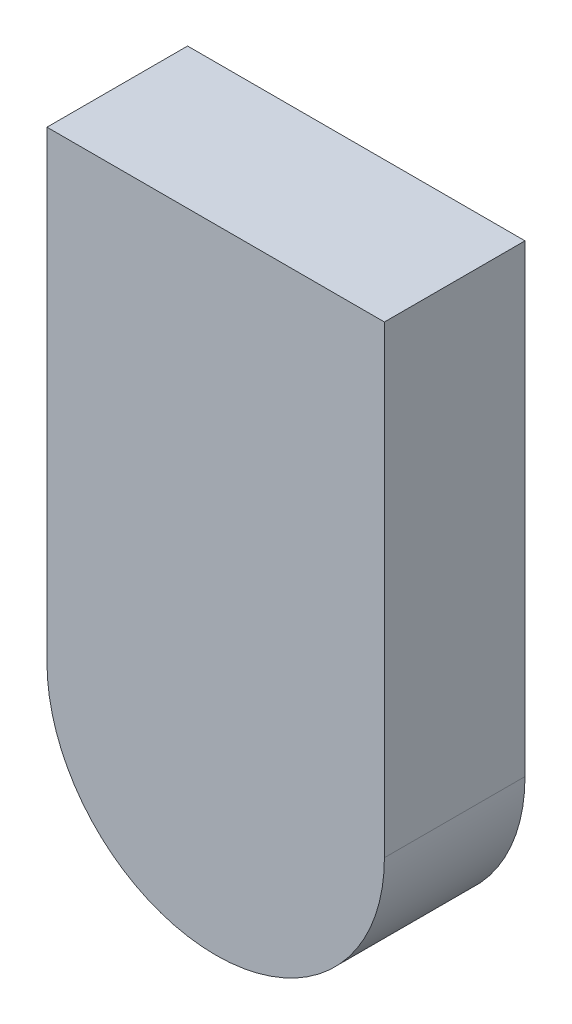
ISO-10303-21;
HEADER;
FILE_DESCRIPTION(('STEP AP214'),'2;1');
FILE_NAME('part.step','',(''),(''),'','','');
FILE_SCHEMA(('AUTOMOTIVE_DESIGN { 1 0 10303 214 1 1 1 1 }'));
ENDSEC;
DATA;
#1=APPLICATION_CONTEXT('core data for automotive mechanical design processes');
#2=APPLICATION_PROTOCOL_DEFINITION('international standard','automotive_design',2000,#1);
#3=PRODUCT_CONTEXT('',#1,'mechanical');
#4=PRODUCT('Part','Part','',(#3));
#5=PRODUCT_RELATED_PRODUCT_CATEGORY('part','',(#4));
#6=PRODUCT_DEFINITION_FORMATION('','',#4);
#7=PRODUCT_DEFINITION_CONTEXT('part definition',#1,'design');
#8=PRODUCT_DEFINITION('design','',#6,#7);
#9=PRODUCT_DEFINITION_SHAPE('','',#8);
#10=(LENGTH_UNIT() NAMED_UNIT(*) SI_UNIT(.MILLI.,.METRE.));
#11=(NAMED_UNIT(*) PLANE_ANGLE_UNIT() SI_UNIT($,.RADIAN.));
#12=(NAMED_UNIT(*) SI_UNIT($,.STERADIAN.) SOLID_ANGLE_UNIT());
#13=UNCERTAINTY_MEASURE_WITH_UNIT(LENGTH_MEASURE(1.E-05),#10,'distance_accuracy_value','');
#14=(GEOMETRIC_REPRESENTATION_CONTEXT(3) GLOBAL_UNCERTAINTY_ASSIGNED_CONTEXT((#13)) GLOBAL_UNIT_ASSIGNED_CONTEXT((#10,
#11,#12)) REPRESENTATION_CONTEXT('',''));
#15=CARTESIAN_POINT('',(0.,0.,0.));
#16=DIRECTION('',(0.,0.,1.));
#17=DIRECTION('',(1.,0.,0.));
#18=AXIS2_PLACEMENT_3D('',#15,#16,#17);
#19=CARTESIAN_POINT('',(-0.37,4.05,0.));
#20=DIRECTION('',(0.,1.,0.));
#21=DIRECTION('',(1.,0.,0.));
#22=AXIS2_PLACEMENT_3D('',#19,#20,#21);
#23=PLANE('',#22);
#24=DIRECTION('',(0.,0.,1.));
#25=VECTOR('',#24,1.);
#26=CARTESIAN_POINT('',(-0.37,4.05,0.));
#27=LINE('',#26,#25);
#28=CARTESIAN_POINT('',(-0.37,4.05,0.));
#29=VERTEX_POINT('',#28);
#30=CARTESIAN_POINT('',(-0.37,4.05,0.1));
#31=VERTEX_POINT('',#30);
#32=EDGE_CURVE('E11',#29,#31,#27,.T.);
#33=ORIENTED_EDGE('',*,*,#32,.T.);
#34=DIRECTION('',(1.,0.,0.));
#35=VECTOR('',#34,1.);
#36=CARTESIAN_POINT('',(-0.37,4.05,0.1));
#37=LINE('',#36,#35);
#38=CARTESIAN_POINT('',(-0.13,4.05,0.1));
#39=VERTEX_POINT('',#38);
#40=EDGE_CURVE('E24',#31,#39,#37,.T.);
#41=ORIENTED_EDGE('',*,*,#40,.T.);
#42=DIRECTION('',(0.,0.,1.));
#43=VECTOR('',#42,1.);
#44=CARTESIAN_POINT('',(-0.13,4.05,0.));
#45=LINE('',#44,#43);
#46=CARTESIAN_POINT('',(-0.13,4.05,0.));
#47=VERTEX_POINT('',#46);
#48=EDGE_CURVE('E85',#47,#39,#45,.T.);
#49=ORIENTED_EDGE('',*,*,#48,.F.);
#50=DIRECTION('',(1.,0.,0.));
#51=VECTOR('',#50,1.);
#52=CARTESIAN_POINT('',(-0.37,4.05,0.));
#53=LINE('',#52,#51);
#54=EDGE_CURVE('E82',#29,#47,#53,.T.);
#55=ORIENTED_EDGE('',*,*,#54,.F.);
#56=EDGE_LOOP('',(#33,#41,#49,#55));
#57=FACE_BOUND('',#56,.T.);
#58=ADVANCED_FACE('F17',(#57),#23,.T.);
#59=CARTESIAN_POINT('',(-0.13,4.05,0.));
#60=DIRECTION('',(1.,0.,0.));
#61=DIRECTION('',(0.,-1.,0.));
#62=AXIS2_PLACEMENT_3D('',#59,#60,#61);
#63=PLANE('',#62);
#64=ORIENTED_EDGE('',*,*,#48,.T.);
#65=DIRECTION('',(0.,-1.,0.));
#66=VECTOR('',#65,1.);
#67=CARTESIAN_POINT('',(-0.13,4.05,0.1));
#68=LINE('',#67,#66);
#69=CARTESIAN_POINT('',(-0.13,3.72,0.1));
#70=VERTEX_POINT('',#69);
#71=EDGE_CURVE('E80',#39,#70,#68,.T.);
#72=ORIENTED_EDGE('',*,*,#71,.T.);
#73=DIRECTION('',(0.,0.,1.));
#74=VECTOR('',#73,1.);
#75=CARTESIAN_POINT('',(-0.13,3.72,0.));
#76=LINE('',#75,#74);
#77=CARTESIAN_POINT('',(-0.13,3.72,0.));
#78=VERTEX_POINT('',#77);
#79=EDGE_CURVE('E60',#78,#70,#76,.T.);
#80=ORIENTED_EDGE('',*,*,#79,.F.);
#81=DIRECTION('',(0.,-1.,0.));
#82=VECTOR('',#81,1.);
#83=CARTESIAN_POINT('',(-0.13,4.05,0.));
#84=LINE('',#83,#82);
#85=EDGE_CURVE('E76',#47,#78,#84,.T.);
#86=ORIENTED_EDGE('',*,*,#85,.F.);
#87=EDGE_LOOP('',(#64,#72,#80,#86));
#88=FACE_BOUND('',#87,.T.);
#89=ADVANCED_FACE('F89',(#88),#63,.T.);
#90=CARTESIAN_POINT('',(-0.25,3.72,0.));
#91=DIRECTION('',(0.,0.,-1.));
#92=DIRECTION('',(1.,0.,0.));
#93=AXIS2_PLACEMENT_3D('',#90,#91,#92);
#94=CYLINDRICAL_SURFACE('',#93,0.12);
#95=CARTESIAN_POINT('',(-0.25,3.72,0.));
#96=DIRECTION('',(0.,0.,1.));
#97=DIRECTION('',(1.,0.,0.));
#98=AXIS2_PLACEMENT_3D('',#95,#96,#97);
#99=CIRCLE('',#98,0.12);
#100=CARTESIAN_POINT('',(-0.37,3.72,0.));
#101=VERTEX_POINT('',#100);
#102=EDGE_CURVE('E64',#101,#78,#99,.T.);
#103=ORIENTED_EDGE('',*,*,#102,.T.);
#104=ORIENTED_EDGE('',*,*,#79,.T.);
#105=CARTESIAN_POINT('',(-0.25,3.72,0.1));
#106=DIRECTION('',(0.,0.,1.));
#107=DIRECTION('',(1.,0.,0.));
#108=AXIS2_PLACEMENT_3D('',#105,#106,#107);
#109=CIRCLE('',#108,0.12);
#110=CARTESIAN_POINT('',(-0.37,3.72,0.1));
#111=VERTEX_POINT('',#110);
#112=EDGE_CURVE('E55',#111,#70,#109,.T.);
#113=ORIENTED_EDGE('',*,*,#112,.F.);
#114=DIRECTION('',(0.,0.,1.));
#115=VECTOR('',#114,1.);
#116=CARTESIAN_POINT('',(-0.37,3.72,0.));
#117=LINE('',#116,#115);
#118=EDGE_CURVE('E59',#101,#111,#117,.T.);
#119=ORIENTED_EDGE('',*,*,#118,.F.);
#120=EDGE_LOOP('',(#103,#104,#113,#119));
#121=FACE_BOUND('',#120,.T.);
#122=ADVANCED_FACE('F58',(#121),#94,.T.);
#123=CARTESIAN_POINT('',(-0.37,4.05,0.));
#124=DIRECTION('',(1.,0.,0.));
#125=DIRECTION('',(0.,-1.,0.));
#126=AXIS2_PLACEMENT_3D('',#123,#124,#125);
#127=PLANE('',#126);
#128=DIRECTION('',(0.,-1.,0.));
#129=VECTOR('',#128,1.);
#130=CARTESIAN_POINT('',(-0.37,4.05,0.));
#131=LINE('',#130,#129);
#132=EDGE_CURVE('E69',#29,#101,#131,.T.);
#133=ORIENTED_EDGE('',*,*,#132,.T.);
#134=ORIENTED_EDGE('',*,*,#118,.T.);
#135=DIRECTION('',(0.,-1.,0.));
#136=VECTOR('',#135,1.);
#137=CARTESIAN_POINT('',(-0.37,4.05,0.1));
#138=LINE('',#137,#136);
#139=EDGE_CURVE('E67',#31,#111,#138,.T.);
#140=ORIENTED_EDGE('',*,*,#139,.F.);
#141=ORIENTED_EDGE('',*,*,#32,.F.);
#142=EDGE_LOOP('',(#133,#134,#140,#141));
#143=FACE_BOUND('',#142,.T.);
#144=ADVANCED_FACE('F66',(#143),#127,.F.);
#145=CARTESIAN_POINT('',(-0.25,3.849490847913,0.));
#146=DIRECTION('',(0.,0.,-1.));
#147=DIRECTION('',(-1.,0.,0.));
#148=AXIS2_PLACEMENT_3D('',#145,#146,#147);
#149=PLANE('',#148);
#150=ORIENTED_EDGE('',*,*,#54,.T.);
#151=ORIENTED_EDGE('',*,*,#85,.T.);
#152=ORIENTED_EDGE('',*,*,#102,.F.);
#153=ORIENTED_EDGE('',*,*,#132,.F.);
#154=EDGE_LOOP('',(#150,#151,#152,#153));
#155=FACE_BOUND('',#154,.T.);
#156=ADVANCED_FACE('F91',(#155),#149,.T.);
#157=CARTESIAN_POINT('',(-0.25,3.849490847913,0.1));
#158=DIRECTION('',(0.,0.,-1.));
#159=DIRECTION('',(-1.,0.,0.));
#160=AXIS2_PLACEMENT_3D('',#157,#158,#159);
#161=PLANE('',#160);
#162=ORIENTED_EDGE('',*,*,#139,.T.);
#163=ORIENTED_EDGE('',*,*,#112,.T.);
#164=ORIENTED_EDGE('',*,*,#71,.F.);
#165=ORIENTED_EDGE('',*,*,#40,.F.);
#166=EDGE_LOOP('',(#162,#163,#164,#165));
#167=FACE_BOUND('',#166,.T.);
#168=ADVANCED_FACE('F71',(#167),#161,.F.);
#169=CLOSED_SHELL('',(#58,#89,#122,#144,#156,#168));
#170=MANIFOLD_SOLID_BREP('B1',#169);
#171=ADVANCED_BREP_SHAPE_REPRESENTATION('',(#18,#170),#14);
#172=SHAPE_DEFINITION_REPRESENTATION(#9,#171);
ENDSEC;
END-ISO-10303-21;
